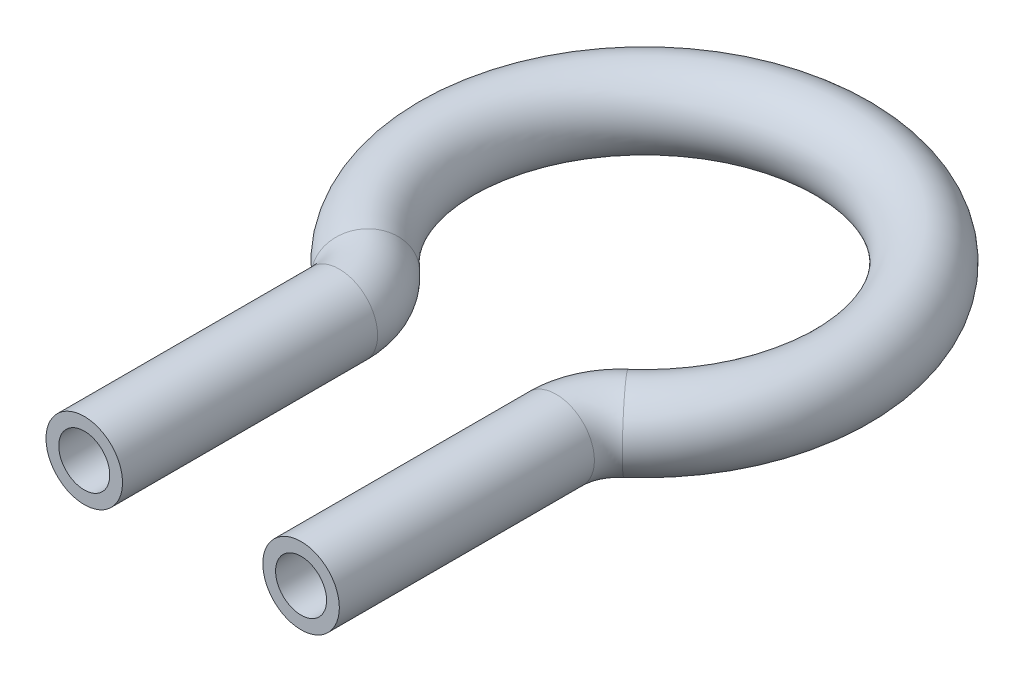
ISO-10303-21;
HEADER;
FILE_DESCRIPTION(('STEP AP214'),'2;1');
FILE_NAME('part.step','',(''),(''),'','','');
FILE_SCHEMA(('AUTOMOTIVE_DESIGN { 1 0 10303 214 1 1 1 1 }'));
ENDSEC;
DATA;
#1=APPLICATION_CONTEXT('core data for automotive mechanical design processes');
#2=APPLICATION_PROTOCOL_DEFINITION('international standard','automotive_design',2000,#1);
#3=PRODUCT_CONTEXT('',#1,'mechanical');
#4=PRODUCT('Part','Part','',(#3));
#5=PRODUCT_RELATED_PRODUCT_CATEGORY('part','',(#4));
#6=PRODUCT_DEFINITION_FORMATION('','',#4);
#7=PRODUCT_DEFINITION_CONTEXT('part definition',#1,'design');
#8=PRODUCT_DEFINITION('design','',#6,#7);
#9=PRODUCT_DEFINITION_SHAPE('','',#8);
#10=(LENGTH_UNIT() NAMED_UNIT(*) SI_UNIT(.MILLI.,.METRE.));
#11=(NAMED_UNIT(*) PLANE_ANGLE_UNIT() SI_UNIT($,.RADIAN.));
#12=(NAMED_UNIT(*) SI_UNIT($,.STERADIAN.) SOLID_ANGLE_UNIT());
#13=UNCERTAINTY_MEASURE_WITH_UNIT(LENGTH_MEASURE(1.E-05),#10,'distance_accuracy_value','');
#14=(GEOMETRIC_REPRESENTATION_CONTEXT(3) GLOBAL_UNCERTAINTY_ASSIGNED_CONTEXT((#13)) GLOBAL_UNIT_ASSIGNED_CONTEXT((#10,
#11,#12)) REPRESENTATION_CONTEXT('',''));
#15=CARTESIAN_POINT('',(0.,0.,0.));
#16=DIRECTION('',(0.,0.,1.));
#17=DIRECTION('',(1.,0.,0.));
#18=AXIS2_PLACEMENT_3D('',#15,#16,#17);
#19=CARTESIAN_POINT('',(-8.5,0.,35.4272486205415));
#20=DIRECTION('',(0.,0.,-1.));
#21=DIRECTION('',(-1.,0.,0.));
#22=AXIS2_PLACEMENT_3D('',#19,#20,#21);
#23=CYLINDRICAL_SURFACE('',#22,3.);
#24=CARTESIAN_POINT('',(-8.5,0.,15.4272486205415));
#25=DIRECTION('',(0.,0.,-1.));
#26=DIRECTION('',(-1.,0.,0.));
#27=AXIS2_PLACEMENT_3D('',#24,#25,#26);
#28=CIRCLE('',#27,3.);
#29=CARTESIAN_POINT('',(-5.49999999999999,0.,15.4272486205415));
#30=VERTEX_POINT('',#29);
#31=EDGE_CURVE('E65',#30,#30,#28,.T.);
#32=ORIENTED_EDGE('',*,*,#31,.F.);
#33=EDGE_LOOP('',(#32));
#34=FACE_BOUND('',#33,.T.);
#35=CARTESIAN_POINT('',(-8.5,0.,35.4272486205415));
#36=DIRECTION('',(0.,0.,-1.));
#37=DIRECTION('',(-1.,0.,0.));
#38=AXIS2_PLACEMENT_3D('',#35,#36,#37);
#39=CIRCLE('',#38,3.);
#40=CARTESIAN_POINT('',(-11.5,0.,35.4272486205415));
#41=VERTEX_POINT('',#40);
#42=EDGE_CURVE('E61',#41,#41,#39,.T.);
#43=ORIENTED_EDGE('',*,*,#42,.T.);
#44=EDGE_LOOP('',(#43));
#45=FACE_BOUND('',#44,.T.);
#46=ADVANCED_FACE('F37',(#34,#45),#23,.T.);
#47=CARTESIAN_POINT('',(-13.5,0.,15.4272486205415));
#48=DIRECTION('',(0.,1.,0.));
#49=DIRECTION('',(0.,0.,1.));
#50=AXIS2_PLACEMENT_3D('',#47,#48,#49);
#51=TOROIDAL_SURFACE('',#50,5.00000000000002,3.);
#52=CARTESIAN_POINT('',(-10.2073170731707,0.,11.6645050545558));
#53=DIRECTION('',(-0.752548713197146,0.,-0.658536585365855));
#54=DIRECTION('',(-0.658536585365855,0.,0.752548713197146));
#55=AXIS2_PLACEMENT_3D('',#52,#53,#54);
#56=CIRCLE('',#55,3.);
#57=CARTESIAN_POINT('',(-8.23170731707316,0.,9.40685891496433));
#58=VERTEX_POINT('',#57);
#59=EDGE_CURVE('E69',#58,#58,#56,.T.);
#60=CARTESIAN_POINT('',(-13.5,0.,15.4272486205415));
#61=DIRECTION('',(0.,1.,0.));
#62=DIRECTION('',(0.,0.,1.));
#63=AXIS2_PLACEMENT_3D('',#60,#61,#62);
#64=CIRCLE('',#63,8.00000000000002);
#65=EDGE_CURVE('',#30,#58,#64,.T.);
#66=ORIENTED_EDGE('',*,*,#31,.T.);
#67=ORIENTED_EDGE('',*,*,#59,.F.);
#68=ORIENTED_EDGE('',*,*,#65,.T.);
#69=ORIENTED_EDGE('',*,*,#65,.F.);
#70=EDGE_LOOP('',(#66,#68,#67,#69));
#71=FACE_BOUND('',#70,.T.);
#72=ADVANCED_FACE('F91',(#71),#51,.T.);
#73=CARTESIAN_POINT('',(0.,0.,0.));
#74=DIRECTION('',(0.,-1.,0.));
#75=DIRECTION('',(0.,0.,-1.));
#76=AXIS2_PLACEMENT_3D('',#73,#74,#75);
#77=TOROIDAL_SURFACE('',#76,15.5,3.);
#78=CARTESIAN_POINT('',(10.2073170731707,0.,11.6645050545558));
#79=DIRECTION('',(-0.752548713197146,0.,0.658536585365854));
#80=DIRECTION('',(0.658536585365854,0.,0.752548713197146));
#81=AXIS2_PLACEMENT_3D('',#78,#79,#80);
#82=CIRCLE('',#81,3.);
#83=CARTESIAN_POINT('',(8.23170731707319,0.,9.40685891496433));
#84=VERTEX_POINT('',#83);
#85=EDGE_CURVE('E72',#84,#84,#82,.T.);
#86=ORIENTED_EDGE('',*,*,#85,.F.);
#87=EDGE_LOOP('',(#86));
#88=FACE_BOUND('',#87,.T.);
#89=ORIENTED_EDGE('',*,*,#59,.T.);
#90=EDGE_LOOP('',(#89));
#91=FACE_BOUND('',#90,.T.);
#92=ADVANCED_FACE('F84',(#88,#91),#77,.T.);
#93=CARTESIAN_POINT('',(13.5,0.,15.4272486205415));
#94=DIRECTION('',(0.,1.,0.));
#95=DIRECTION('',(0.,0.,1.));
#96=AXIS2_PLACEMENT_3D('',#93,#94,#95);
#97=TOROIDAL_SURFACE('',#96,5.,3.);
#98=CARTESIAN_POINT('',(8.5,0.,15.4272486205415));
#99=DIRECTION('',(0.,0.,1.));
#100=DIRECTION('',(1.,0.,0.));
#101=AXIS2_PLACEMENT_3D('',#98,#99,#100);
#102=CIRCLE('',#101,3.);
#103=CARTESIAN_POINT('',(5.50000000000001,0.,15.4272486205415));
#104=VERTEX_POINT('',#103);
#105=EDGE_CURVE('E41',#104,#104,#102,.T.);
#106=CARTESIAN_POINT('',(13.5,0.,15.4272486205415));
#107=DIRECTION('',(0.,1.,0.));
#108=DIRECTION('',(0.,0.,1.));
#109=AXIS2_PLACEMENT_3D('',#106,#107,#108);
#110=CIRCLE('',#109,7.99999999999999);
#111=EDGE_CURVE('',#84,#104,#110,.T.);
#112=ORIENTED_EDGE('',*,*,#85,.T.);
#113=ORIENTED_EDGE('',*,*,#105,.F.);
#114=ORIENTED_EDGE('',*,*,#111,.T.);
#115=ORIENTED_EDGE('',*,*,#111,.F.);
#116=EDGE_LOOP('',(#112,#114,#113,#115));
#117=FACE_BOUND('',#116,.T.);
#118=ADVANCED_FACE('F82',(#117),#97,.T.);
#119=CARTESIAN_POINT('',(8.5,0.,15.4272486205415));
#120=DIRECTION('',(0.,0.,1.));
#121=DIRECTION('',(1.,0.,0.));
#122=AXIS2_PLACEMENT_3D('',#119,#120,#121);
#123=CYLINDRICAL_SURFACE('',#122,3.);
#124=CARTESIAN_POINT('',(8.5,0.,35.4272486205415));
#125=DIRECTION('',(0.,0.,1.));
#126=DIRECTION('',(1.,0.,0.));
#127=AXIS2_PLACEMENT_3D('',#124,#125,#126);
#128=CIRCLE('',#127,3.);
#129=CARTESIAN_POINT('',(11.5,0.,35.4272486205415));
#130=VERTEX_POINT('',#129);
#131=EDGE_CURVE('E56',#130,#130,#128,.T.);
#132=ORIENTED_EDGE('',*,*,#131,.F.);
#133=EDGE_LOOP('',(#132));
#134=FACE_BOUND('',#133,.T.);
#135=ORIENTED_EDGE('',*,*,#105,.T.);
#136=EDGE_LOOP('',(#135));
#137=FACE_BOUND('',#136,.T.);
#138=ADVANCED_FACE('F39',(#134,#137),#123,.T.);
#139=CARTESIAN_POINT('',(-8.5,0.,35.4272486205415));
#140=DIRECTION('',(0.,0.,-1.));
#141=DIRECTION('',(-1.,0.,0.));
#142=AXIS2_PLACEMENT_3D('',#139,#140,#141);
#143=PLANE('',#142);
#144=CARTESIAN_POINT('',(-8.5,0.,35.4272486205415));
#145=DIRECTION('',(0.,0.,-1.));
#146=DIRECTION('',(-1.,0.,0.));
#147=AXIS2_PLACEMENT_3D('',#144,#145,#146);
#148=CIRCLE('',#147,2.);
#149=CARTESIAN_POINT('',(-10.5,0.,35.4272486205415));
#150=VERTEX_POINT('',#149);
#151=EDGE_CURVE('E60',#150,#150,#148,.F.);
#152=ORIENTED_EDGE('',*,*,#151,.F.);
#153=EDGE_LOOP('',(#152));
#154=FACE_BOUND('',#153,.T.);
#155=ORIENTED_EDGE('',*,*,#42,.F.);
#156=EDGE_LOOP('',(#155));
#157=FACE_BOUND('',#156,.T.);
#158=ADVANCED_FACE('F89',(#154,#157),#143,.F.);
#159=CARTESIAN_POINT('',(8.5,0.,35.4272486205415));
#160=DIRECTION('',(0.,0.,1.));
#161=DIRECTION('',(1.,0.,0.));
#162=AXIS2_PLACEMENT_3D('',#159,#160,#161);
#163=PLANE('',#162);
#164=CARTESIAN_POINT('',(8.5,0.,35.4272486205415));
#165=DIRECTION('',(0.,0.,1.));
#166=DIRECTION('',(1.,0.,0.));
#167=AXIS2_PLACEMENT_3D('',#164,#165,#166);
#168=CIRCLE('',#167,2.);
#169=CARTESIAN_POINT('',(10.5,0.,35.4272486205415));
#170=VERTEX_POINT('',#169);
#171=EDGE_CURVE('E10',#170,#170,#168,.F.);
#172=ORIENTED_EDGE('',*,*,#171,.T.);
#173=EDGE_LOOP('',(#172));
#174=FACE_BOUND('',#173,.T.);
#175=ORIENTED_EDGE('',*,*,#131,.T.);
#176=EDGE_LOOP('',(#175));
#177=FACE_BOUND('',#176,.T.);
#178=ADVANCED_FACE('F108',(#174,#177),#163,.T.);
#179=CARTESIAN_POINT('',(-8.5,0.,35.4272486205415));
#180=DIRECTION('',(0.,0.,-1.));
#181=DIRECTION('',(-1.,0.,0.));
#182=AXIS2_PLACEMENT_3D('',#179,#180,#181);
#183=CYLINDRICAL_SURFACE('',#182,2.);
#184=CARTESIAN_POINT('',(-8.5,0.,15.4272486205415));
#185=DIRECTION('',(0.,0.,-1.));
#186=DIRECTION('',(-1.,0.,0.));
#187=AXIS2_PLACEMENT_3D('',#184,#185,#186);
#188=CIRCLE('',#187,2.);
#189=CARTESIAN_POINT('',(-6.49999999999999,0.,15.4272486205415));
#190=VERTEX_POINT('',#189);
#191=EDGE_CURVE('E205',#190,#190,#188,.F.);
#192=ORIENTED_EDGE('',*,*,#191,.F.);
#193=EDGE_LOOP('',(#192));
#194=FACE_BOUND('',#193,.T.);
#195=ORIENTED_EDGE('',*,*,#151,.T.);
#196=EDGE_LOOP('',(#195));
#197=FACE_BOUND('',#196,.T.);
#198=ADVANCED_FACE('F111',(#194,#197),#183,.F.);
#199=CARTESIAN_POINT('',(-13.5,0.,15.4272486205415));
#200=DIRECTION('',(0.,1.,0.));
#201=DIRECTION('',(0.,0.,1.));
#202=AXIS2_PLACEMENT_3D('',#199,#200,#201);
#203=TOROIDAL_SURFACE('',#202,5.00000000000002,2.);
#204=CARTESIAN_POINT('',(-10.2073170731707,0.,11.6645050545558));
#205=DIRECTION('',(-0.752548713197146,0.,-0.658536585365855));
#206=DIRECTION('',(-0.658536585365855,0.,0.752548713197146));
#207=AXIS2_PLACEMENT_3D('',#204,#205,#206);
#208=CIRCLE('',#207,2.);
#209=CARTESIAN_POINT('',(-8.89024390243901,0.,10.1594076281615));
#210=VERTEX_POINT('',#209);
#211=EDGE_CURVE('E203',#210,#210,#208,.F.);
#212=CARTESIAN_POINT('',(-13.5,0.,15.4272486205415));
#213=DIRECTION('',(0.,1.,0.));
#214=DIRECTION('',(0.,0.,1.));
#215=AXIS2_PLACEMENT_3D('',#212,#213,#214);
#216=CIRCLE('',#215,7.00000000000002);
#217=EDGE_CURVE('',#190,#210,#216,.T.);
#218=ORIENTED_EDGE('',*,*,#191,.T.);
#219=ORIENTED_EDGE('',*,*,#211,.F.);
#220=ORIENTED_EDGE('',*,*,#217,.T.);
#221=ORIENTED_EDGE('',*,*,#217,.F.);
#222=EDGE_LOOP('',(#218,#220,#219,#221));
#223=FACE_BOUND('',#222,.T.);
#224=ADVANCED_FACE('F166',(#223),#203,.F.);
#225=CARTESIAN_POINT('',(0.,0.,0.));
#226=DIRECTION('',(0.,-1.,0.));
#227=DIRECTION('',(0.,0.,-1.));
#228=AXIS2_PLACEMENT_3D('',#225,#226,#227);
#229=TOROIDAL_SURFACE('',#228,15.5,2.);
#230=CARTESIAN_POINT('',(10.2073170731707,0.,11.6645050545558));
#231=DIRECTION('',(-0.752548713197146,0.,0.658536585365854));
#232=DIRECTION('',(0.658536585365854,0.,0.752548713197146));
#233=AXIS2_PLACEMENT_3D('',#230,#231,#232);
#234=CIRCLE('',#233,2.);
#235=CARTESIAN_POINT('',(8.89024390243904,0.,10.1594076281615));
#236=VERTEX_POINT('',#235);
#237=EDGE_CURVE('E52',#236,#236,#234,.F.);
#238=ORIENTED_EDGE('',*,*,#237,.F.);
#239=EDGE_LOOP('',(#238));
#240=FACE_BOUND('',#239,.T.);
#241=ORIENTED_EDGE('',*,*,#211,.T.);
#242=EDGE_LOOP('',(#241));
#243=FACE_BOUND('',#242,.T.);
#244=ADVANCED_FACE('F102',(#240,#243),#229,.F.);
#245=CARTESIAN_POINT('',(13.5,0.,15.4272486205415));
#246=DIRECTION('',(0.,1.,0.));
#247=DIRECTION('',(0.,0.,1.));
#248=AXIS2_PLACEMENT_3D('',#245,#246,#247);
#249=TOROIDAL_SURFACE('',#248,5.,2.);
#250=CARTESIAN_POINT('',(8.5,0.,15.4272486205415));
#251=DIRECTION('',(0.,0.,1.));
#252=DIRECTION('',(1.,0.,0.));
#253=AXIS2_PLACEMENT_3D('',#250,#251,#252);
#254=CIRCLE('',#253,2.);
#255=CARTESIAN_POINT('',(6.5,0.,15.4272486205415));
#256=VERTEX_POINT('',#255);
#257=EDGE_CURVE('E46',#256,#256,#254,.F.);
#258=CARTESIAN_POINT('',(13.5,0.,15.4272486205415));
#259=DIRECTION('',(0.,1.,0.));
#260=DIRECTION('',(0.,0.,1.));
#261=AXIS2_PLACEMENT_3D('',#258,#259,#260);
#262=CIRCLE('',#261,7.);
#263=EDGE_CURVE('',#236,#256,#262,.T.);
#264=ORIENTED_EDGE('',*,*,#237,.T.);
#265=ORIENTED_EDGE('',*,*,#257,.F.);
#266=ORIENTED_EDGE('',*,*,#263,.T.);
#267=ORIENTED_EDGE('',*,*,#263,.F.);
#268=EDGE_LOOP('',(#264,#266,#265,#267));
#269=FACE_BOUND('',#268,.T.);
#270=ADVANCED_FACE('F96',(#269),#249,.F.);
#271=CARTESIAN_POINT('',(8.5,0.,15.4272486205415));
#272=DIRECTION('',(0.,0.,1.));
#273=DIRECTION('',(1.,0.,0.));
#274=AXIS2_PLACEMENT_3D('',#271,#272,#273);
#275=CYLINDRICAL_SURFACE('',#274,2.);
#276=ORIENTED_EDGE('',*,*,#171,.F.);
#277=EDGE_LOOP('',(#276));
#278=FACE_BOUND('',#277,.T.);
#279=ORIENTED_EDGE('',*,*,#257,.T.);
#280=EDGE_LOOP('',(#279));
#281=FACE_BOUND('',#280,.T.);
#282=ADVANCED_FACE('F94',(#278,#281),#275,.F.);
#283=CLOSED_SHELL('',(#46,#72,#92,#118,#138,#158,#178,#198,#224,#244,#270,#282));
#284=MANIFOLD_SOLID_BREP('B2',#283);
#285=ADVANCED_BREP_SHAPE_REPRESENTATION('',(#18,#284),#14);
#286=SHAPE_DEFINITION_REPRESENTATION(#9,#285);
ENDSEC;
END-ISO-10303-21;
